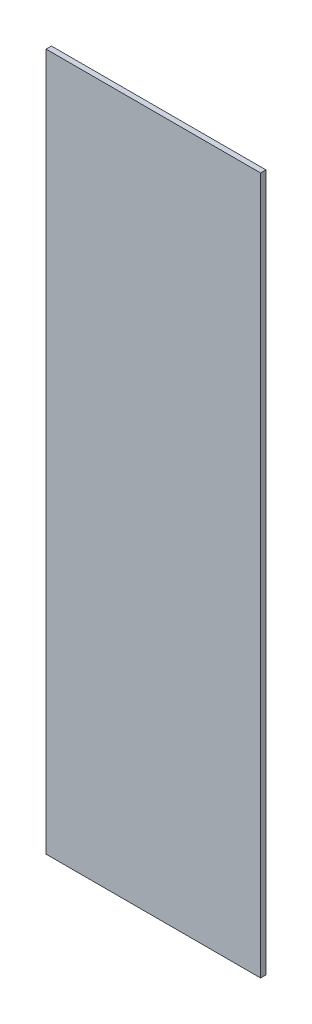
ISO-10303-21;
HEADER;
FILE_DESCRIPTION(('STEP AP214'),'2;1');
FILE_NAME('part.step','',(''),(''),'','','');
FILE_SCHEMA(('AUTOMOTIVE_DESIGN { 1 0 10303 214 1 1 1 1 }'));
ENDSEC;
DATA;
#1=APPLICATION_CONTEXT('core data for automotive mechanical design processes');
#2=APPLICATION_PROTOCOL_DEFINITION('international standard','automotive_design',2000,#1);
#3=PRODUCT_CONTEXT('',#1,'mechanical');
#4=PRODUCT('Part','Part','',(#3));
#5=PRODUCT_RELATED_PRODUCT_CATEGORY('part','',(#4));
#6=PRODUCT_DEFINITION_FORMATION('','',#4);
#7=PRODUCT_DEFINITION_CONTEXT('part definition',#1,'design');
#8=PRODUCT_DEFINITION('design','',#6,#7);
#9=PRODUCT_DEFINITION_SHAPE('','',#8);
#10=(LENGTH_UNIT() NAMED_UNIT(*) SI_UNIT(.MILLI.,.METRE.));
#11=(NAMED_UNIT(*) PLANE_ANGLE_UNIT() SI_UNIT($,.RADIAN.));
#12=(NAMED_UNIT(*) SI_UNIT($,.STERADIAN.) SOLID_ANGLE_UNIT());
#13=UNCERTAINTY_MEASURE_WITH_UNIT(LENGTH_MEASURE(1.E-05),#10,'distance_accuracy_value','');
#14=(GEOMETRIC_REPRESENTATION_CONTEXT(3) GLOBAL_UNCERTAINTY_ASSIGNED_CONTEXT((#13)) GLOBAL_UNIT_ASSIGNED_CONTEXT((#10,
#11,#12)) REPRESENTATION_CONTEXT('',''));
#15=CARTESIAN_POINT('',(0.,0.,0.));
#16=DIRECTION('',(0.,0.,1.));
#17=DIRECTION('',(1.,0.,0.));
#18=AXIS2_PLACEMENT_3D('',#15,#16,#17);
#19=CARTESIAN_POINT('',(0.414734603858307,0.65,0.99));
#20=DIRECTION('',(0.,0.,1.));
#21=DIRECTION('',(1.,0.,0.));
#22=AXIS2_PLACEMENT_3D('',#19,#20,#21);
#23=PLANE('',#22);
#24=DIRECTION('',(-1.,0.,0.));
#25=VECTOR('',#24,1.);
#26=CARTESIAN_POINT('',(0.814734603858307,0.65,0.99));
#27=LINE('',#26,#25);
#28=CARTESIAN_POINT('',(0.814734603858307,0.65,0.99));
#29=VERTEX_POINT('',#28);
#30=CARTESIAN_POINT('',(0.414734603858307,0.65,0.99));
#31=VERTEX_POINT('',#30);
#32=EDGE_CURVE('E11',#29,#31,#27,.T.);
#33=ORIENTED_EDGE('',*,*,#32,.F.);
#34=DIRECTION('',(0.,1.,0.));
#35=VECTOR('',#34,1.);
#36=CARTESIAN_POINT('',(0.814734603858307,-0.65,0.99));
#37=LINE('',#36,#35);
#38=CARTESIAN_POINT('',(0.814734603858307,-0.65,0.99));
#39=VERTEX_POINT('',#38);
#40=EDGE_CURVE('E24',#39,#29,#37,.T.);
#41=ORIENTED_EDGE('',*,*,#40,.F.);
#42=DIRECTION('',(1.,0.,0.));
#43=VECTOR('',#42,1.);
#44=CARTESIAN_POINT('',(0.414734603858307,-0.65,0.99));
#45=LINE('',#44,#43);
#46=CARTESIAN_POINT('',(0.414734603858307,-0.65,0.99));
#47=VERTEX_POINT('',#46);
#48=EDGE_CURVE('E88',#47,#39,#45,.T.);
#49=ORIENTED_EDGE('',*,*,#48,.F.);
#50=DIRECTION('',(0.,-1.,0.));
#51=VECTOR('',#50,1.);
#52=CARTESIAN_POINT('',(0.414734603858307,0.65,0.99));
#53=LINE('',#52,#51);
#54=EDGE_CURVE('E72',#31,#47,#53,.T.);
#55=ORIENTED_EDGE('',*,*,#54,.F.);
#56=EDGE_LOOP('',(#33,#41,#49,#55));
#57=FACE_BOUND('',#56,.T.);
#58=ADVANCED_FACE('F17',(#57),#23,.F.);
#59=CARTESIAN_POINT('',(0.814734603858307,-0.65,1.));
#60=DIRECTION('',(-1.,0.,0.));
#61=DIRECTION('',(0.,-1.,0.));
#62=AXIS2_PLACEMENT_3D('',#59,#60,#61);
#63=PLANE('',#62);
#64=ORIENTED_EDGE('',*,*,#40,.T.);
#65=DIRECTION('',(0.,0.,-1.));
#66=VECTOR('',#65,1.);
#67=CARTESIAN_POINT('',(0.814734603858307,0.65,1.));
#68=LINE('',#67,#66);
#69=CARTESIAN_POINT('',(0.814734603858307,0.65,1.));
#70=VERTEX_POINT('',#69);
#71=EDGE_CURVE('E85',#70,#29,#68,.T.);
#72=ORIENTED_EDGE('',*,*,#71,.F.);
#73=DIRECTION('',(0.,1.,0.));
#74=VECTOR('',#73,1.);
#75=CARTESIAN_POINT('',(0.814734603858307,-0.65,1.));
#76=LINE('',#75,#74);
#77=CARTESIAN_POINT('',(0.814734603858307,-0.65,1.));
#78=VERTEX_POINT('',#77);
#79=EDGE_CURVE('E83',#78,#70,#76,.T.);
#80=ORIENTED_EDGE('',*,*,#79,.F.);
#81=DIRECTION('',(0.,0.,-1.));
#82=VECTOR('',#81,1.);
#83=CARTESIAN_POINT('',(0.814734603858307,-0.65,1.));
#84=LINE('',#83,#82);
#85=EDGE_CURVE('E60',#78,#39,#84,.T.);
#86=ORIENTED_EDGE('',*,*,#85,.T.);
#87=EDGE_LOOP('',(#64,#72,#80,#86));
#88=FACE_BOUND('',#87,.T.);
#89=ADVANCED_FACE('F90',(#88),#63,.F.);
#90=CARTESIAN_POINT('',(0.814734603858307,0.65,1.));
#91=DIRECTION('',(0.,-1.,0.));
#92=DIRECTION('',(1.,0.,0.));
#93=AXIS2_PLACEMENT_3D('',#90,#91,#92);
#94=PLANE('',#93);
#95=ORIENTED_EDGE('',*,*,#32,.T.);
#96=DIRECTION('',(0.,0.,-1.));
#97=VECTOR('',#96,1.);
#98=CARTESIAN_POINT('',(0.414734603858307,0.65,1.));
#99=LINE('',#98,#97);
#100=CARTESIAN_POINT('',(0.414734603858307,0.65,1.));
#101=VERTEX_POINT('',#100);
#102=EDGE_CURVE('E80',#101,#31,#99,.T.);
#103=ORIENTED_EDGE('',*,*,#102,.F.);
#104=DIRECTION('',(-1.,0.,0.));
#105=VECTOR('',#104,1.);
#106=CARTESIAN_POINT('',(0.814734603858307,0.65,1.));
#107=LINE('',#106,#105);
#108=EDGE_CURVE('E64',#70,#101,#107,.T.);
#109=ORIENTED_EDGE('',*,*,#108,.F.);
#110=ORIENTED_EDGE('',*,*,#71,.T.);
#111=EDGE_LOOP('',(#95,#103,#109,#110));
#112=FACE_BOUND('',#111,.T.);
#113=ADVANCED_FACE('F91',(#112),#94,.F.);
#114=CARTESIAN_POINT('',(0.414734603858307,-0.65,1.));
#115=DIRECTION('',(0.,1.,0.));
#116=DIRECTION('',(0.,0.,1.));
#117=AXIS2_PLACEMENT_3D('',#114,#115,#116);
#118=PLANE('',#117);
#119=ORIENTED_EDGE('',*,*,#48,.T.);
#120=ORIENTED_EDGE('',*,*,#85,.F.);
#121=DIRECTION('',(1.,0.,0.));
#122=VECTOR('',#121,1.);
#123=CARTESIAN_POINT('',(0.414734603858307,-0.65,1.));
#124=LINE('',#123,#122);
#125=CARTESIAN_POINT('',(0.414734603858307,-0.65,1.));
#126=VERTEX_POINT('',#125);
#127=EDGE_CURVE('E54',#126,#78,#124,.T.);
#128=ORIENTED_EDGE('',*,*,#127,.F.);
#129=DIRECTION('',(0.,0.,-1.));
#130=VECTOR('',#129,1.);
#131=CARTESIAN_POINT('',(0.414734603858307,-0.65,1.));
#132=LINE('',#131,#130);
#133=EDGE_CURVE('E58',#126,#47,#132,.T.);
#134=ORIENTED_EDGE('',*,*,#133,.T.);
#135=EDGE_LOOP('',(#119,#120,#128,#134));
#136=FACE_BOUND('',#135,.T.);
#137=ADVANCED_FACE('F57',(#136),#118,.F.);
#138=CARTESIAN_POINT('',(0.414734603858307,0.65,1.));
#139=DIRECTION('',(1.,0.,0.));
#140=DIRECTION('',(0.,1.,0.));
#141=AXIS2_PLACEMENT_3D('',#138,#139,#140);
#142=PLANE('',#141);
#143=ORIENTED_EDGE('',*,*,#54,.T.);
#144=ORIENTED_EDGE('',*,*,#133,.F.);
#145=DIRECTION('',(0.,-1.,0.));
#146=VECTOR('',#145,1.);
#147=CARTESIAN_POINT('',(0.414734603858307,0.65,1.));
#148=LINE('',#147,#146);
#149=EDGE_CURVE('E71',#101,#126,#148,.T.);
#150=ORIENTED_EDGE('',*,*,#149,.F.);
#151=ORIENTED_EDGE('',*,*,#102,.T.);
#152=EDGE_LOOP('',(#143,#144,#150,#151));
#153=FACE_BOUND('',#152,.T.);
#154=ADVANCED_FACE('F69',(#153),#142,.F.);
#155=CARTESIAN_POINT('',(0.414734603858307,0.65,1.));
#156=DIRECTION('',(0.,0.,1.));
#157=DIRECTION('',(1.,0.,0.));
#158=AXIS2_PLACEMENT_3D('',#155,#156,#157);
#159=PLANE('',#158);
#160=ORIENTED_EDGE('',*,*,#108,.T.);
#161=ORIENTED_EDGE('',*,*,#149,.T.);
#162=ORIENTED_EDGE('',*,*,#127,.T.);
#163=ORIENTED_EDGE('',*,*,#79,.T.);
#164=EDGE_LOOP('',(#160,#161,#162,#163));
#165=FACE_BOUND('',#164,.T.);
#166=ADVANCED_FACE('F75',(#165),#159,.T.);
#167=CLOSED_SHELL('',(#58,#89,#113,#137,#154,#166));
#168=MANIFOLD_SOLID_BREP('B1',#167);
#169=ADVANCED_BREP_SHAPE_REPRESENTATION('',(#18,#168),#14);
#170=SHAPE_DEFINITION_REPRESENTATION(#9,#169);
ENDSEC;
END-ISO-10303-21;
